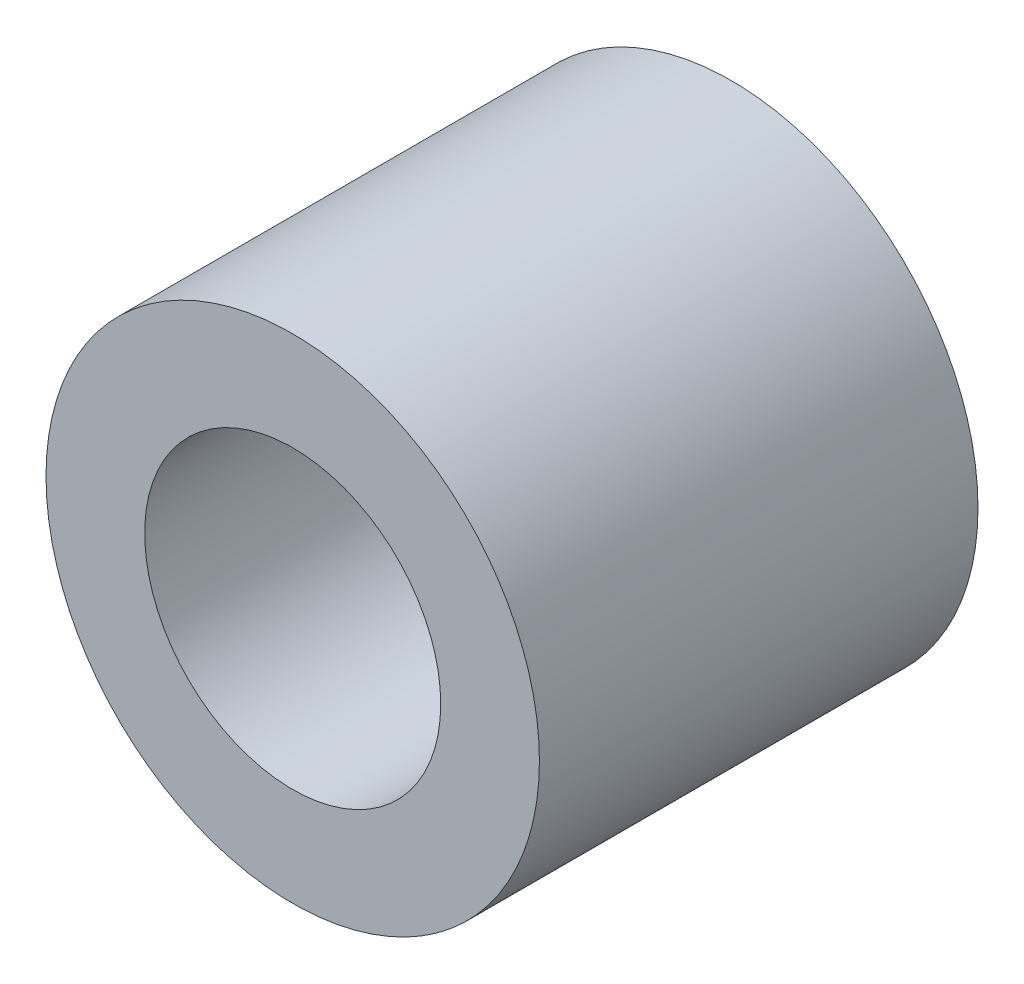
ISO-10303-21;
HEADER;
FILE_DESCRIPTION(('STEP AP214'),'2;1');
FILE_NAME('part.step','',(''),(''),'','','');
FILE_SCHEMA(('AUTOMOTIVE_DESIGN { 1 0 10303 214 1 1 1 1 }'));
ENDSEC;
DATA;
#1=APPLICATION_CONTEXT('core data for automotive mechanical design processes');
#2=APPLICATION_PROTOCOL_DEFINITION('international standard','automotive_design',2000,#1);
#3=PRODUCT_CONTEXT('',#1,'mechanical');
#4=PRODUCT('Part','Part','',(#3));
#5=PRODUCT_RELATED_PRODUCT_CATEGORY('part','',(#4));
#6=PRODUCT_DEFINITION_FORMATION('','',#4);
#7=PRODUCT_DEFINITION_CONTEXT('part definition',#1,'design');
#8=PRODUCT_DEFINITION('design','',#6,#7);
#9=PRODUCT_DEFINITION_SHAPE('','',#8);
#10=(LENGTH_UNIT() NAMED_UNIT(*) SI_UNIT(.MILLI.,.METRE.));
#11=(NAMED_UNIT(*) PLANE_ANGLE_UNIT() SI_UNIT($,.RADIAN.));
#12=(NAMED_UNIT(*) SI_UNIT($,.STERADIAN.) SOLID_ANGLE_UNIT());
#13=UNCERTAINTY_MEASURE_WITH_UNIT(LENGTH_MEASURE(1.E-05),#10,'distance_accuracy_value','');
#14=(GEOMETRIC_REPRESENTATION_CONTEXT(3) GLOBAL_UNCERTAINTY_ASSIGNED_CONTEXT((#13)) GLOBAL_UNIT_ASSIGNED_CONTEXT((#10,
#11,#12)) REPRESENTATION_CONTEXT('',''));
#15=CARTESIAN_POINT('',(0.,0.,0.));
#16=DIRECTION('',(0.,0.,1.));
#17=DIRECTION('',(1.,0.,0.));
#18=AXIS2_PLACEMENT_3D('',#15,#16,#17);
#19=CARTESIAN_POINT('',(0.,0.,2.));
#20=DIRECTION('',(0.,0.,1.));
#21=DIRECTION('',(1.,0.,0.));
#22=AXIS2_PLACEMENT_3D('',#19,#20,#21);
#23=PLANE('',#22);
#24=CARTESIAN_POINT('',(0.,0.,2.));
#25=DIRECTION('',(0.,0.,1.));
#26=DIRECTION('',(1.,0.,0.));
#27=AXIS2_PLACEMENT_3D('',#24,#25,#26);
#28=CIRCLE('',#27,2.25);
#29=CARTESIAN_POINT('',(2.25,0.,2.));
#30=VERTEX_POINT('',#29);
#31=EDGE_CURVE('E10',#30,#30,#28,.T.);
#32=ORIENTED_EDGE('',*,*,#31,.T.);
#33=EDGE_LOOP('',(#32));
#34=FACE_BOUND('',#33,.T.);
#35=CARTESIAN_POINT('',(0.,0.,2.));
#36=DIRECTION('',(0.,0.,1.));
#37=DIRECTION('',(1.,0.,0.));
#38=AXIS2_PLACEMENT_3D('',#35,#36,#37);
#39=CIRCLE('',#38,1.35);
#40=CARTESIAN_POINT('',(1.35,0.,2.));
#41=VERTEX_POINT('',#40);
#42=EDGE_CURVE('E44',#41,#41,#39,.T.);
#43=ORIENTED_EDGE('',*,*,#42,.F.);
#44=EDGE_LOOP('',(#43));
#45=FACE_BOUND('',#44,.T.);
#46=ADVANCED_FACE('F33',(#34,#45),#23,.T.);
#47=CARTESIAN_POINT('',(0.,0.,-2.));
#48=DIRECTION('',(0.,0.,1.));
#49=DIRECTION('',(1.,0.,0.));
#50=AXIS2_PLACEMENT_3D('',#47,#48,#49);
#51=PLANE('',#50);
#52=CARTESIAN_POINT('',(0.,0.,-2.));
#53=DIRECTION('',(0.,0.,1.));
#54=DIRECTION('',(1.,0.,0.));
#55=AXIS2_PLACEMENT_3D('',#52,#53,#54);
#56=CIRCLE('',#55,2.25);
#57=CARTESIAN_POINT('',(2.25,0.,-2.));
#58=VERTEX_POINT('',#57);
#59=EDGE_CURVE('E37',#58,#58,#56,.T.);
#60=ORIENTED_EDGE('',*,*,#59,.F.);
#61=EDGE_LOOP('',(#60));
#62=FACE_BOUND('',#61,.T.);
#63=CARTESIAN_POINT('',(0.,0.,-2.));
#64=DIRECTION('',(0.,0.,1.));
#65=DIRECTION('',(1.,0.,0.));
#66=AXIS2_PLACEMENT_3D('',#63,#64,#65);
#67=CIRCLE('',#66,1.35);
#68=CARTESIAN_POINT('',(1.35,0.,-2.));
#69=VERTEX_POINT('',#68);
#70=EDGE_CURVE('E46',#69,#69,#67,.T.);
#71=ORIENTED_EDGE('',*,*,#70,.T.);
#72=EDGE_LOOP('',(#71));
#73=FACE_BOUND('',#72,.T.);
#74=ADVANCED_FACE('F56',(#62,#73),#51,.F.);
#75=CARTESIAN_POINT('',(0.,0.,2.));
#76=DIRECTION('',(0.,0.,-1.));
#77=DIRECTION('',(-1.,0.,0.));
#78=AXIS2_PLACEMENT_3D('',#75,#76,#77);
#79=CYLINDRICAL_SURFACE('',#78,2.25);
#80=ORIENTED_EDGE('',*,*,#31,.F.);
#81=EDGE_LOOP('',(#80));
#82=FACE_BOUND('',#81,.T.);
#83=ORIENTED_EDGE('',*,*,#59,.T.);
#84=EDGE_LOOP('',(#83));
#85=FACE_BOUND('',#84,.T.);
#86=ADVANCED_FACE('F35',(#82,#85),#79,.T.);
#87=CARTESIAN_POINT('',(0.,0.,2.));
#88=DIRECTION('',(0.,0.,-1.));
#89=DIRECTION('',(-1.,0.,0.));
#90=AXIS2_PLACEMENT_3D('',#87,#88,#89);
#91=CYLINDRICAL_SURFACE('',#90,1.35);
#92=ORIENTED_EDGE('',*,*,#42,.T.);
#93=EDGE_LOOP('',(#92));
#94=FACE_BOUND('',#93,.T.);
#95=ORIENTED_EDGE('',*,*,#70,.F.);
#96=EDGE_LOOP('',(#95));
#97=FACE_BOUND('',#96,.T.);
#98=ADVANCED_FACE('F52',(#94,#97),#91,.F.);
#99=CLOSED_SHELL('',(#46,#74,#86,#98));
#100=MANIFOLD_SOLID_BREP('B2',#99);
#101=ADVANCED_BREP_SHAPE_REPRESENTATION('',(#18,#100),#14);
#102=SHAPE_DEFINITION_REPRESENTATION(#9,#101);
ENDSEC;
END-ISO-10303-21;
